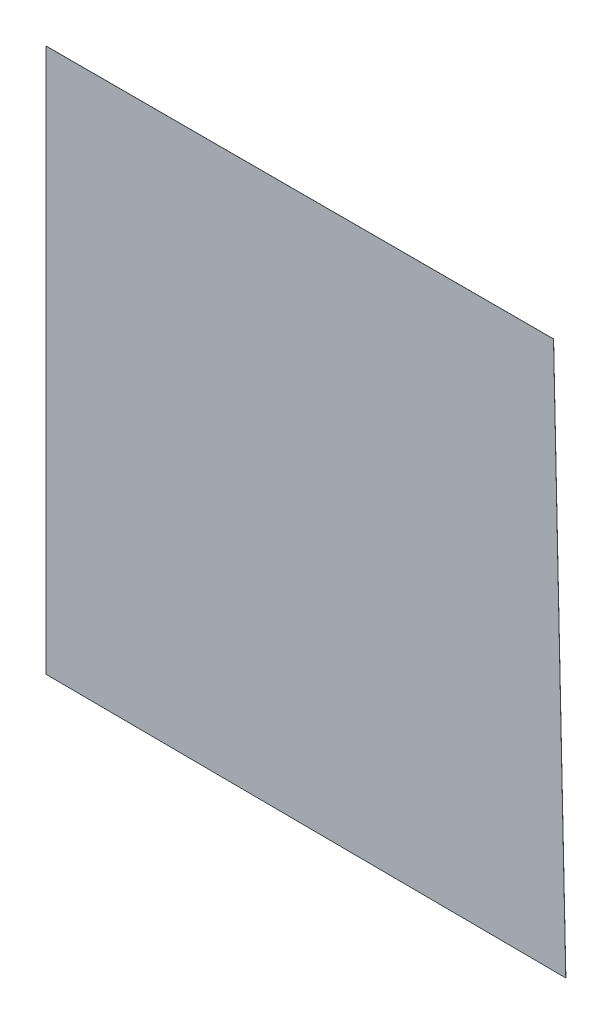
ISO-10303-21;
HEADER;
FILE_DESCRIPTION(('STEP AP214'),'2;1');
FILE_NAME('part.step','',(''),(''),'','','');
FILE_SCHEMA(('AUTOMOTIVE_DESIGN { 1 0 10303 214 1 1 1 1 }'));
ENDSEC;
DATA;
#1=APPLICATION_CONTEXT('core data for automotive mechanical design processes');
#2=APPLICATION_PROTOCOL_DEFINITION('international standard','automotive_design',2000,#1);
#3=PRODUCT_CONTEXT('',#1,'mechanical');
#4=PRODUCT('Part','Part','',(#3));
#5=PRODUCT_RELATED_PRODUCT_CATEGORY('part','',(#4));
#6=PRODUCT_DEFINITION_FORMATION('','',#4);
#7=PRODUCT_DEFINITION_CONTEXT('part definition',#1,'design');
#8=PRODUCT_DEFINITION('design','',#6,#7);
#9=PRODUCT_DEFINITION_SHAPE('','',#8);
#10=(LENGTH_UNIT() NAMED_UNIT(*) SI_UNIT(.MILLI.,.METRE.));
#11=(NAMED_UNIT(*) PLANE_ANGLE_UNIT() SI_UNIT($,.RADIAN.));
#12=(NAMED_UNIT(*) SI_UNIT($,.STERADIAN.) SOLID_ANGLE_UNIT());
#13=UNCERTAINTY_MEASURE_WITH_UNIT(LENGTH_MEASURE(1.E-05),#10,'distance_accuracy_value','');
#14=(GEOMETRIC_REPRESENTATION_CONTEXT(3) GLOBAL_UNCERTAINTY_ASSIGNED_CONTEXT((#13)) GLOBAL_UNIT_ASSIGNED_CONTEXT((#10,
#11,#12)) REPRESENTATION_CONTEXT('',''));
#15=CARTESIAN_POINT('',(0.,0.,0.));
#16=DIRECTION('',(0.,0.,1.));
#17=DIRECTION('',(1.,0.,0.));
#18=AXIS2_PLACEMENT_3D('',#15,#16,#17);
#19=CARTESIAN_POINT('',(5945.70087656659,15552.259521188,2.54));
#20=DIRECTION('',(0.,-1.,0.));
#21=DIRECTION('',(0.,0.,-1.));
#22=AXIS2_PLACEMENT_3D('',#19,#20,#21);
#23=PLANE('',#22);
#24=DIRECTION('',(-1.,0.,0.));
#25=VECTOR('',#24,1.);
#26=CARTESIAN_POINT('',(5945.70087656659,15552.259521188,0.));
#27=LINE('',#26,#25);
#28=CARTESIAN_POINT('',(5945.70087656659,15552.259521188,0.));
#29=VERTEX_POINT('',#28);
#30=CARTESIAN_POINT('',(-11732.6991234334,15552.259521188,0.));
#31=VERTEX_POINT('',#30);
#32=EDGE_CURVE('E113',#29,#31,#27,.T.);
#33=ORIENTED_EDGE('',*,*,#32,.T.);
#34=DIRECTION('',(0.,0.,-1.));
#35=VECTOR('',#34,1.);
#36=CARTESIAN_POINT('',(-11732.6991234334,15552.259521188,2.54));
#37=LINE('',#36,#35);
#38=CARTESIAN_POINT('',(-11732.6991234334,15552.259521188,2.54));
#39=VERTEX_POINT('',#38);
#40=EDGE_CURVE('E11',#39,#31,#37,.T.);
#41=ORIENTED_EDGE('',*,*,#40,.F.);
#42=DIRECTION('',(-1.,0.,0.));
#43=VECTOR('',#42,1.);
#44=CARTESIAN_POINT('',(5945.70087656659,15552.259521188,2.54));
#45=LINE('',#44,#43);
#46=CARTESIAN_POINT('',(5945.70087656659,15552.259521188,2.54));
#47=VERTEX_POINT('',#46);
#48=EDGE_CURVE('E96',#47,#39,#45,.T.);
#49=ORIENTED_EDGE('',*,*,#48,.F.);
#50=DIRECTION('',(0.,0.,-1.));
#51=VECTOR('',#50,1.);
#52=CARTESIAN_POINT('',(5945.70087656659,15552.259521188,2.54));
#53=LINE('',#52,#51);
#54=EDGE_CURVE('E109',#47,#29,#53,.T.);
#55=ORIENTED_EDGE('',*,*,#54,.T.);
#56=EDGE_LOOP('',(#33,#41,#49,#55));
#57=FACE_BOUND('',#56,.T.);
#58=ADVANCED_FACE('F44',(#57),#23,.F.);
#59=CARTESIAN_POINT('',(-11732.6991234334,15552.259521188,2.54));
#60=DIRECTION('',(1.,0.,0.));
#61=DIRECTION('',(0.,0.,-1.));
#62=AXIS2_PLACEMENT_3D('',#59,#60,#61);
#63=PLANE('',#62);
#64=DIRECTION('',(0.,-1.,0.));
#65=VECTOR('',#64,1.);
#66=CARTESIAN_POINT('',(-11732.6991234334,15552.259521188,0.));
#67=LINE('',#66,#65);
#68=CARTESIAN_POINT('',(-11732.6991234334,-3406.30047881198,0.));
#69=VERTEX_POINT('',#68);
#70=EDGE_CURVE('E101',#31,#69,#67,.T.);
#71=ORIENTED_EDGE('',*,*,#70,.T.);
#72=DIRECTION('',(0.,0.,-1.));
#73=VECTOR('',#72,1.);
#74=CARTESIAN_POINT('',(-11732.6991234334,-3406.30047881198,2.54));
#75=LINE('',#74,#73);
#76=CARTESIAN_POINT('',(-11732.6991234334,-3406.30047881198,2.54));
#77=VERTEX_POINT('',#76);
#78=EDGE_CURVE('E53',#77,#69,#75,.T.);
#79=ORIENTED_EDGE('',*,*,#78,.F.);
#80=DIRECTION('',(0.,-1.,0.));
#81=VECTOR('',#80,1.);
#82=CARTESIAN_POINT('',(-11732.6991234334,15552.259521188,2.54));
#83=LINE('',#82,#81);
#84=EDGE_CURVE('E91',#39,#77,#83,.T.);
#85=ORIENTED_EDGE('',*,*,#84,.F.);
#86=ORIENTED_EDGE('',*,*,#40,.T.);
#87=EDGE_LOOP('',(#71,#79,#85,#86));
#88=FACE_BOUND('',#87,.T.);
#89=ADVANCED_FACE('F100',(#88),#63,.F.);
#90=CARTESIAN_POINT('',(-11732.6991234334,-3406.30047881198,2.54));
#91=DIRECTION('',(0.00602539655686685,0.999981847133403,0.));
#92=DIRECTION('',(-0.999981847133403,0.00602539655686685,0.));
#93=AXIS2_PLACEMENT_3D('',#90,#91,#92);
#94=PLANE('',#93);
#95=DIRECTION('',(0.999981847133403,-0.00602539655686685,0.));
#96=VECTOR('',#95,1.);
#97=CARTESIAN_POINT('',(-11732.6991234334,-3406.30047881198,0.));
#98=LINE('',#97,#96);
#99=CARTESIAN_POINT('',(6373.76060842734,-3515.40105942567,0.));
#100=VERTEX_POINT('',#99);
#101=EDGE_CURVE('E78',#69,#100,#98,.T.);
#102=ORIENTED_EDGE('',*,*,#101,.T.);
#103=DIRECTION('',(0.,0.,-1.));
#104=VECTOR('',#103,1.);
#105=CARTESIAN_POINT('',(6373.76060842734,-3515.40105942567,2.54));
#106=LINE('',#105,#104);
#107=CARTESIAN_POINT('',(6373.76060842734,-3515.40105942567,2.54));
#108=VERTEX_POINT('',#107);
#109=EDGE_CURVE('E103',#108,#100,#106,.T.);
#110=ORIENTED_EDGE('',*,*,#109,.F.);
#111=DIRECTION('',(0.999981847133403,-0.00602539655686685,0.));
#112=VECTOR('',#111,1.);
#113=CARTESIAN_POINT('',(-11732.6991234334,-3406.30047881198,2.54));
#114=LINE('',#113,#112);
#115=EDGE_CURVE('E94',#77,#108,#114,.T.);
#116=ORIENTED_EDGE('',*,*,#115,.F.);
#117=ORIENTED_EDGE('',*,*,#78,.T.);
#118=EDGE_LOOP('',(#102,#110,#116,#117));
#119=FACE_BOUND('',#118,.T.);
#120=ADVANCED_FACE('F104',(#119),#94,.F.);
#121=CARTESIAN_POINT('',(6373.76060842734,-3515.40105942567,2.54));
#122=DIRECTION('',(-0.999748104847283,-0.022443860057186,0.));
#123=DIRECTION('',(0.022443860057186,-0.999748104847283,0.));
#124=AXIS2_PLACEMENT_3D('',#121,#122,#123);
#125=PLANE('',#124);
#126=DIRECTION('',(-0.022443860057186,0.999748104847283,0.));
#127=VECTOR('',#126,1.);
#128=CARTESIAN_POINT('',(6373.76060842734,-3515.40105942567,0.));
#129=LINE('',#128,#127);
#130=EDGE_CURVE('E84',#100,#29,#129,.T.);
#131=ORIENTED_EDGE('',*,*,#130,.T.);
#132=ORIENTED_EDGE('',*,*,#54,.F.);
#133=DIRECTION('',(-0.022443860057186,0.999748104847283,0.));
#134=VECTOR('',#133,1.);
#135=CARTESIAN_POINT('',(6373.76060842734,-3515.40105942567,2.54));
#136=LINE('',#135,#134);
#137=EDGE_CURVE('E61',#108,#47,#136,.T.);
#138=ORIENTED_EDGE('',*,*,#137,.F.);
#139=ORIENTED_EDGE('',*,*,#109,.T.);
#140=EDGE_LOOP('',(#131,#132,#138,#139));
#141=FACE_BOUND('',#140,.T.);
#142=ADVANCED_FACE('F127',(#141),#125,.F.);
#143=CARTESIAN_POINT('',(0.,0.,2.54));
#144=DIRECTION('',(0.,0.,1.));
#145=DIRECTION('',(1.,0.,0.));
#146=AXIS2_PLACEMENT_3D('',#143,#144,#145);
#147=PLANE('',#146);
#148=ORIENTED_EDGE('',*,*,#48,.T.);
#149=ORIENTED_EDGE('',*,*,#84,.T.);
#150=ORIENTED_EDGE('',*,*,#115,.T.);
#151=ORIENTED_EDGE('',*,*,#137,.T.);
#152=EDGE_LOOP('',(#148,#149,#150,#151));
#153=FACE_BOUND('',#152,.T.);
#154=ADVANCED_FACE('F92',(#153),#147,.T.);
#155=CARTESIAN_POINT('',(0.,0.,0.));
#156=DIRECTION('',(0.,0.,1.));
#157=DIRECTION('',(1.,0.,0.));
#158=AXIS2_PLACEMENT_3D('',#155,#156,#157);
#159=PLANE('',#158);
#160=ORIENTED_EDGE('',*,*,#32,.F.);
#161=ORIENTED_EDGE('',*,*,#130,.F.);
#162=ORIENTED_EDGE('',*,*,#101,.F.);
#163=ORIENTED_EDGE('',*,*,#70,.F.);
#164=EDGE_LOOP('',(#160,#161,#162,#163));
#165=FACE_BOUND('',#164,.T.);
#166=ADVANCED_FACE('F130',(#165),#159,.F.);
#167=CLOSED_SHELL('',(#58,#89,#120,#142,#154,#166));
#168=MANIFOLD_SOLID_BREP('B2',#167);
#169=ADVANCED_BREP_SHAPE_REPRESENTATION('',(#18,#168),#14);
#170=SHAPE_DEFINITION_REPRESENTATION(#9,#169);
ENDSEC;
END-ISO-10303-21;
